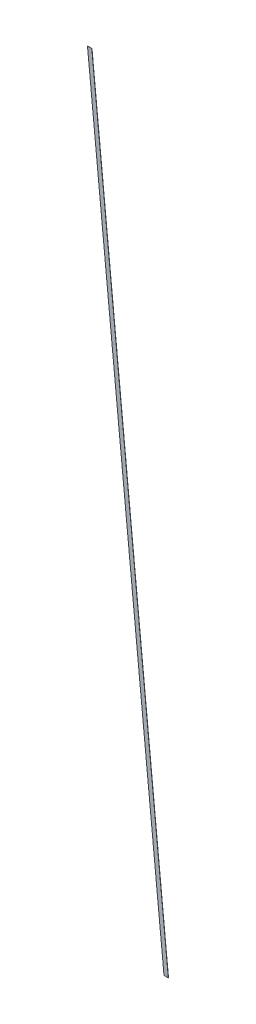
ISO-10303-21;
HEADER;
FILE_DESCRIPTION(('STEP AP214'),'2;1');
FILE_NAME('part.step','',(''),(''),'','','');
FILE_SCHEMA(('AUTOMOTIVE_DESIGN { 1 0 10303 214 1 1 1 1 }'));
ENDSEC;
DATA;
#1=APPLICATION_CONTEXT('core data for automotive mechanical design processes');
#2=APPLICATION_PROTOCOL_DEFINITION('international standard','automotive_design',2000,#1);
#3=PRODUCT_CONTEXT('',#1,'mechanical');
#4=PRODUCT('Part','Part','',(#3));
#5=PRODUCT_RELATED_PRODUCT_CATEGORY('part','',(#4));
#6=PRODUCT_DEFINITION_FORMATION('','',#4);
#7=PRODUCT_DEFINITION_CONTEXT('part definition',#1,'design');
#8=PRODUCT_DEFINITION('design','',#6,#7);
#9=PRODUCT_DEFINITION_SHAPE('','',#8);
#10=(LENGTH_UNIT() NAMED_UNIT(*) SI_UNIT(.MILLI.,.METRE.));
#11=(NAMED_UNIT(*) PLANE_ANGLE_UNIT() SI_UNIT($,.RADIAN.));
#12=(NAMED_UNIT(*) SI_UNIT($,.STERADIAN.) SOLID_ANGLE_UNIT());
#13=UNCERTAINTY_MEASURE_WITH_UNIT(LENGTH_MEASURE(1.E-05),#10,'distance_accuracy_value','');
#14=(GEOMETRIC_REPRESENTATION_CONTEXT(3) GLOBAL_UNCERTAINTY_ASSIGNED_CONTEXT((#13)) GLOBAL_UNIT_ASSIGNED_CONTEXT((#10,
#11,#12)) REPRESENTATION_CONTEXT('',''));
#15=CARTESIAN_POINT('',(0.,0.,0.));
#16=DIRECTION('',(0.,0.,1.));
#17=DIRECTION('',(1.,0.,0.));
#18=AXIS2_PLACEMENT_3D('',#15,#16,#17);
#19=CARTESIAN_POINT('',(-36.4148964321646,-649.224936885858,0.7112));
#20=DIRECTION('',(0.,0.,1.));
#21=DIRECTION('',(0.995055569965199,0.0993197497038353,0.));
#22=AXIS2_PLACEMENT_3D('',#19,#20,#21);
#23=PLANE('',#22);
#24=DIRECTION('',(0.0993197497436046,-0.99505556996123,0.));
#25=VECTOR('',#24,1.);
#26=CARTESIAN_POINT('',(-50.9325846216222,-481.710333743014,0.7112));
#27=LINE('',#26,#25);
#28=CARTESIAN_POINT('',(-34.8767227216478,-642.569325588522,0.7112));
#29=VERTEX_POINT('',#28);
#30=CARTESIAN_POINT('',(-66.9884465216116,-320.851341897505,0.7112));
#31=VERTEX_POINT('',#30);
#32=EDGE_CURVE('E75',#29,#31,#27,.F.);
#33=ORIENTED_EDGE('',*,*,#32,.T.);
#34=DIRECTION('',(1.,0.,0.));
#35=VECTOR('',#34,1.);
#36=CARTESIAN_POINT('',(-67.8946270679165,-320.851341897506,0.7112));
#37=LINE('',#36,#35);
#38=CARTESIAN_POINT('',(-68.8008076142407,-320.851341897506,0.7112));
#39=VERTEX_POINT('',#38);
#40=EDGE_CURVE('E69',#31,#39,#37,.F.);
#41=ORIENTED_EDGE('',*,*,#40,.T.);
#42=DIRECTION('',(-0.0993197497436794,0.995055569961222,0.));
#43=VECTOR('',#42,1.);
#44=CARTESIAN_POINT('',(-52.7449457142537,-481.710333743014,0.7112));
#45=LINE('',#44,#43);
#46=CARTESIAN_POINT('',(-36.6890838142647,-642.569325588521,0.7112));
#47=VERTEX_POINT('',#46);
#48=EDGE_CURVE('E58',#39,#47,#45,.F.);
#49=ORIENTED_EDGE('',*,*,#48,.T.);
#50=DIRECTION('',(-1.,0.,0.));
#51=VECTOR('',#50,1.);
#52=CARTESIAN_POINT('',(-35.7829032679467,-642.569325588522,0.7112));
#53=LINE('',#52,#51);
#54=EDGE_CURVE('E54',#47,#29,#53,.F.);
#55=ORIENTED_EDGE('',*,*,#54,.T.);
#56=EDGE_LOOP('',(#33,#41,#49,#55));
#57=FACE_BOUND('',#56,.T.);
#58=ADVANCED_FACE('F17',(#57),#23,.T.);
#59=CARTESIAN_POINT('',(-69.4430420902446,-314.416982223706,0.633476));
#60=DIRECTION('',(-0.995055569961222,-0.0993197497436794,0.));
#61=DIRECTION('',(0.0993197497436794,-0.995055569961222,0.));
#62=AXIS2_PLACEMENT_3D('',#59,#60,#61);
#63=PLANE('',#62);
#64=ORIENTED_EDGE('',*,*,#48,.F.);
#65=DIRECTION('',(0.,0.,1.));
#66=VECTOR('',#65,1.);
#67=CARTESIAN_POINT('',(-68.8008076142386,-320.851341897506,0.6731));
#68=LINE('',#67,#66);
#69=CARTESIAN_POINT('',(-68.8008076142386,-320.851341897506,0.635));
#70=VERTEX_POINT('',#69);
#71=EDGE_CURVE('E67',#39,#70,#68,.F.);
#72=ORIENTED_EDGE('',*,*,#71,.T.);
#73=DIRECTION('',(0.0993197497436537,-0.995055569961225,0.));
#74=VECTOR('',#73,1.);
#75=CARTESIAN_POINT('',(-52.7360067753735,-481.799890361321,0.635));
#76=LINE('',#75,#74);
#77=CARTESIAN_POINT('',(-36.6890838142647,-642.569325588522,0.635));
#78=VERTEX_POINT('',#77);
#79=EDGE_CURVE('E62',#70,#78,#76,.T.);
#80=ORIENTED_EDGE('',*,*,#79,.T.);
#81=DIRECTION('',(0.,0.,-1.));
#82=VECTOR('',#81,1.);
#83=CARTESIAN_POINT('',(-36.6890838142688,-642.569325588522,0.6731));
#84=LINE('',#83,#82);
#85=EDGE_CURVE('E49',#78,#47,#84,.F.);
#86=ORIENTED_EDGE('',*,*,#85,.T.);
#87=EDGE_LOOP('',(#64,#72,#80,#86));
#88=FACE_BOUND('',#87,.T.);
#89=ADVANCED_FACE('F65',(#88),#63,.T.);
#90=CARTESIAN_POINT('',(-37.0772857809418,-642.569325588522,0.633476));
#91=DIRECTION('',(0.,-1.,0.));
#92=DIRECTION('',(1.,0.,0.));
#93=AXIS2_PLACEMENT_3D('',#90,#91,#92);
#94=PLANE('',#93);
#95=ORIENTED_EDGE('',*,*,#54,.F.);
#96=ORIENTED_EDGE('',*,*,#85,.F.);
#97=DIRECTION('',(1.,0.,0.));
#98=VECTOR('',#97,1.);
#99=CARTESIAN_POINT('',(-37.0772857809418,-642.569325588522,0.635));
#100=LINE('',#99,#98);
#101=CARTESIAN_POINT('',(-34.8767227216457,-642.569325588522,0.635));
#102=VERTEX_POINT('',#101);
#103=EDGE_CURVE('E21',#78,#102,#100,.T.);
#104=ORIENTED_EDGE('',*,*,#103,.T.);
#105=DIRECTION('',(0.,0.,-1.));
#106=VECTOR('',#105,1.);
#107=CARTESIAN_POINT('',(-34.8767227216413,-642.569325588521,0.6731));
#108=LINE('',#107,#106);
#109=EDGE_CURVE('E73',#102,#29,#108,.F.);
#110=ORIENTED_EDGE('',*,*,#109,.T.);
#111=EDGE_LOOP('',(#95,#96,#104,#110));
#112=FACE_BOUND('',#111,.T.);
#113=ADVANCED_FACE('F51',(#112),#94,.T.);
#114=CARTESIAN_POINT('',(-34.234488245644,-649.003685262322,0.633476));
#115=DIRECTION('',(0.99505556996123,0.0993197497436046,0.));
#116=DIRECTION('',(-0.0993197497436046,0.99505556996123,0.));
#117=AXIS2_PLACEMENT_3D('',#114,#115,#116);
#118=PLANE('',#117);
#119=ORIENTED_EDGE('',*,*,#32,.F.);
#120=ORIENTED_EDGE('',*,*,#109,.F.);
#121=DIRECTION('',(-0.0993197497436014,0.99505556996123,0.));
#122=VECTOR('',#121,1.);
#123=CARTESIAN_POINT('',(-50.9415235605065,-481.620777124707,0.635));
#124=LINE('',#123,#122);
#125=CARTESIAN_POINT('',(-66.9884465216154,-320.851341897506,0.635));
#126=VERTEX_POINT('',#125);
#127=EDGE_CURVE('E27',#102,#126,#124,.T.);
#128=ORIENTED_EDGE('',*,*,#127,.T.);
#129=DIRECTION('',(0.,0.,-1.));
#130=VECTOR('',#129,1.);
#131=CARTESIAN_POINT('',(-66.9884465216198,-320.851341897506,0.6731));
#132=LINE('',#131,#130);
#133=EDGE_CURVE('E33',#126,#31,#132,.F.);
#134=ORIENTED_EDGE('',*,*,#133,.T.);
#135=EDGE_LOOP('',(#119,#120,#128,#134));
#136=FACE_BOUND('',#135,.T.);
#137=ADVANCED_FACE('F90',(#136),#118,.T.);
#138=CARTESIAN_POINT('',(-66.6002445549214,-320.851341897506,0.633476));
#139=DIRECTION('',(0.,1.,0.));
#140=DIRECTION('',(-1.,0.,0.));
#141=AXIS2_PLACEMENT_3D('',#138,#139,#140);
#142=PLANE('',#141);
#143=ORIENTED_EDGE('',*,*,#40,.F.);
#144=ORIENTED_EDGE('',*,*,#133,.F.);
#145=DIRECTION('',(-1.,0.,0.));
#146=VECTOR('',#145,1.);
#147=CARTESIAN_POINT('',(-66.6002445549214,-320.851341897506,0.635));
#148=LINE('',#147,#146);
#149=EDGE_CURVE('E11',#126,#70,#148,.T.);
#150=ORIENTED_EDGE('',*,*,#149,.T.);
#151=ORIENTED_EDGE('',*,*,#71,.F.);
#152=EDGE_LOOP('',(#143,#144,#150,#151));
#153=FACE_BOUND('',#152,.T.);
#154=ADVANCED_FACE('F89',(#153),#142,.T.);
#155=CARTESIAN_POINT('',(-36.4148964321646,-649.224936885858,0.635));
#156=DIRECTION('',(0.,0.,1.));
#157=DIRECTION('',(0.995055569965199,0.0993197497038353,0.));
#158=AXIS2_PLACEMENT_3D('',#155,#156,#157);
#159=PLANE('',#158);
#160=ORIENTED_EDGE('',*,*,#127,.F.);
#161=ORIENTED_EDGE('',*,*,#103,.F.);
#162=ORIENTED_EDGE('',*,*,#79,.F.);
#163=ORIENTED_EDGE('',*,*,#149,.F.);
#164=EDGE_LOOP('',(#160,#161,#162,#163));
#165=FACE_BOUND('',#164,.T.);
#166=ADVANCED_FACE('F19',(#165),#159,.F.);
#167=CLOSED_SHELL('',(#58,#89,#113,#137,#154,#166));
#168=MANIFOLD_SOLID_BREP('B1',#167);
#169=ADVANCED_BREP_SHAPE_REPRESENTATION('',(#18,#168),#14);
#170=SHAPE_DEFINITION_REPRESENTATION(#9,#169);
ENDSEC;
END-ISO-10303-21;
